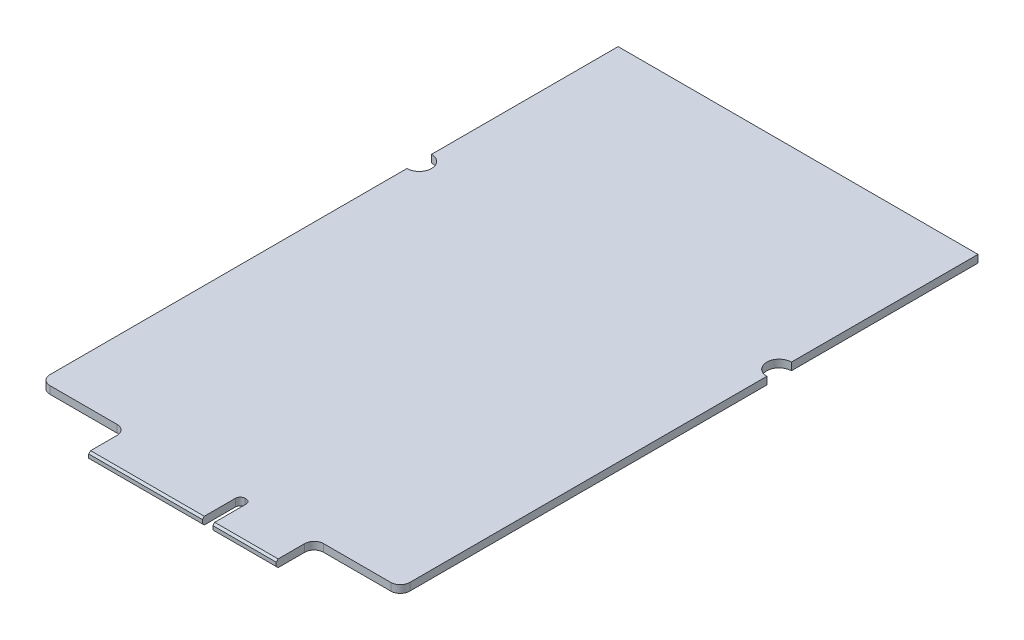
ISO-10303-21;
HEADER;
FILE_DESCRIPTION(('STEP AP214'),'2;1');
FILE_NAME('part.step','',(''),(''),'','','');
FILE_SCHEMA(('AUTOMOTIVE_DESIGN { 1 0 10303 214 1 1 1 1 }'));
ENDSEC;
DATA;
#1=APPLICATION_CONTEXT('core data for automotive mechanical design processes');
#2=APPLICATION_PROTOCOL_DEFINITION('international standard','automotive_design',2000,#1);
#3=PRODUCT_CONTEXT('',#1,'mechanical');
#4=PRODUCT('Part','Part','',(#3));
#5=PRODUCT_RELATED_PRODUCT_CATEGORY('part','',(#4));
#6=PRODUCT_DEFINITION_FORMATION('','',#4);
#7=PRODUCT_DEFINITION_CONTEXT('part definition',#1,'design');
#8=PRODUCT_DEFINITION('design','',#6,#7);
#9=PRODUCT_DEFINITION_SHAPE('','',#8);
#10=(LENGTH_UNIT() NAMED_UNIT(*) SI_UNIT(.MILLI.,.METRE.));
#11=(NAMED_UNIT(*) PLANE_ANGLE_UNIT() SI_UNIT($,.RADIAN.));
#12=(NAMED_UNIT(*) SI_UNIT($,.STERADIAN.) SOLID_ANGLE_UNIT());
#13=UNCERTAINTY_MEASURE_WITH_UNIT(LENGTH_MEASURE(1.E-05),#10,'distance_accuracy_value','');
#14=(GEOMETRIC_REPRESENTATION_CONTEXT(3) GLOBAL_UNCERTAINTY_ASSIGNED_CONTEXT((#13)) GLOBAL_UNIT_ASSIGNED_CONTEXT((#10,
#11,#12)) REPRESENTATION_CONTEXT('',''));
#15=CARTESIAN_POINT('',(0.,0.,0.));
#16=DIRECTION('',(0.,0.,1.));
#17=DIRECTION('',(1.,0.,0.));
#18=AXIS2_PLACEMENT_3D('',#15,#16,#17);
#19=CARTESIAN_POINT('',(38.,0.8,-45.3));
#20=DIRECTION('',(-1.,0.,0.));
#21=DIRECTION('',(0.,0.,1.));
#22=AXIS2_PLACEMENT_3D('',#19,#20,#21);
#23=PLANE('',#22);
#24=DIRECTION('',(0.,0.,-1.));
#25=VECTOR('',#24,1.);
#26=CARTESIAN_POINT('',(38.,0.,-45.3));
#27=LINE('',#26,#25);
#28=CARTESIAN_POINT('',(38.,0.,-45.3));
#29=VERTEX_POINT('',#28);
#30=CARTESIAN_POINT('',(38.,0.,-65.));
#31=VERTEX_POINT('',#30);
#32=EDGE_CURVE('E230',#29,#31,#27,.T.);
#33=ORIENTED_EDGE('',*,*,#32,.T.);
#34=DIRECTION('',(0.,-1.,0.));
#35=VECTOR('',#34,1.);
#36=CARTESIAN_POINT('',(38.,0.8,-65.));
#37=LINE('',#36,#35);
#38=CARTESIAN_POINT('',(38.,0.8,-65.));
#39=VERTEX_POINT('',#38);
#40=EDGE_CURVE('E210',#39,#31,#37,.T.);
#41=ORIENTED_EDGE('',*,*,#40,.F.);
#42=DIRECTION('',(0.,0.,-1.));
#43=VECTOR('',#42,1.);
#44=CARTESIAN_POINT('',(38.,0.8,-45.3));
#45=LINE('',#44,#43);
#46=CARTESIAN_POINT('',(38.,0.8,-45.3));
#47=VERTEX_POINT('',#46);
#48=EDGE_CURVE('E217',#47,#39,#45,.T.);
#49=ORIENTED_EDGE('',*,*,#48,.F.);
#50=DIRECTION('',(0.,-1.,0.));
#51=VECTOR('',#50,1.);
#52=CARTESIAN_POINT('',(38.,0.8,-45.3));
#53=LINE('',#52,#51);
#54=EDGE_CURVE('E366',#47,#29,#53,.T.);
#55=ORIENTED_EDGE('',*,*,#54,.T.);
#56=EDGE_LOOP('',(#33,#41,#49,#55));
#57=FACE_BOUND('',#56,.T.);
#58=ADVANCED_FACE('F33',(#57),#23,.F.);
#59=CARTESIAN_POINT('',(0.,0.8,-65.));
#60=DIRECTION('',(0.,0.,1.));
#61=DIRECTION('',(1.,0.,0.));
#62=AXIS2_PLACEMENT_3D('',#59,#60,#61);
#63=PLANE('',#62);
#64=DIRECTION('',(-1.,0.,0.));
#65=VECTOR('',#64,1.);
#66=CARTESIAN_POINT('',(0.,0.,-65.));
#67=LINE('',#66,#65);
#68=CARTESIAN_POINT('',(0.,0.,-65.));
#69=VERTEX_POINT('',#68);
#70=EDGE_CURVE('E403',#31,#69,#67,.T.);
#71=ORIENTED_EDGE('',*,*,#70,.T.);
#72=DIRECTION('',(0.,-1.,0.));
#73=VECTOR('',#72,1.);
#74=CARTESIAN_POINT('',(0.,0.8,-65.));
#75=LINE('',#74,#73);
#76=CARTESIAN_POINT('',(0.,0.8,-65.));
#77=VERTEX_POINT('',#76);
#78=EDGE_CURVE('E213',#77,#69,#75,.T.);
#79=ORIENTED_EDGE('',*,*,#78,.F.);
#80=DIRECTION('',(-1.,0.,0.));
#81=VECTOR('',#80,1.);
#82=CARTESIAN_POINT('',(0.,0.8,-65.));
#83=LINE('',#82,#81);
#84=EDGE_CURVE('E206',#39,#77,#83,.T.);
#85=ORIENTED_EDGE('',*,*,#84,.F.);
#86=ORIENTED_EDGE('',*,*,#40,.T.);
#87=EDGE_LOOP('',(#71,#79,#85,#86));
#88=FACE_BOUND('',#87,.T.);
#89=ADVANCED_FACE('F208',(#88),#63,.F.);
#90=CARTESIAN_POINT('',(0.,0.8,-45.3));
#91=DIRECTION('',(1.,0.,0.));
#92=DIRECTION('',(0.,0.,-1.));
#93=AXIS2_PLACEMENT_3D('',#90,#91,#92);
#94=PLANE('',#93);
#95=DIRECTION('',(0.,0.,1.));
#96=VECTOR('',#95,1.);
#97=CARTESIAN_POINT('',(0.,0.,-45.3));
#98=LINE('',#97,#96);
#99=CARTESIAN_POINT('',(0.,0.,-45.3));
#100=VERTEX_POINT('',#99);
#101=EDGE_CURVE('E397',#69,#100,#98,.T.);
#102=ORIENTED_EDGE('',*,*,#101,.T.);
#103=DIRECTION('',(0.,-1.,0.));
#104=VECTOR('',#103,1.);
#105=CARTESIAN_POINT('',(0.,0.8,-45.3));
#106=LINE('',#105,#104);
#107=CARTESIAN_POINT('',(0.,0.8,-45.3));
#108=VERTEX_POINT('',#107);
#109=EDGE_CURVE('E235',#108,#100,#106,.T.);
#110=ORIENTED_EDGE('',*,*,#109,.F.);
#111=DIRECTION('',(0.,0.,1.));
#112=VECTOR('',#111,1.);
#113=CARTESIAN_POINT('',(0.,0.8,-45.3));
#114=LINE('',#113,#112);
#115=EDGE_CURVE('E216',#77,#108,#114,.T.);
#116=ORIENTED_EDGE('',*,*,#115,.F.);
#117=ORIENTED_EDGE('',*,*,#78,.T.);
#118=EDGE_LOOP('',(#102,#110,#116,#117));
#119=FACE_BOUND('',#118,.T.);
#120=ADVANCED_FACE('F449',(#119),#94,.F.);
#121=CARTESIAN_POINT('',(0.,0.8,-44.));
#122=DIRECTION('',(0.,-1.,0.));
#123=DIRECTION('',(0.,0.,-1.));
#124=AXIS2_PLACEMENT_3D('',#121,#122,#123);
#125=CYLINDRICAL_SURFACE('',#124,1.3);
#126=CARTESIAN_POINT('',(0.,0.,-44.));
#127=DIRECTION('',(0.,-1.,0.));
#128=DIRECTION('',(0.,0.,1.));
#129=AXIS2_PLACEMENT_3D('',#126,#127,#128);
#130=CIRCLE('',#129,1.3);
#131=CARTESIAN_POINT('',(0.,0.,-42.7));
#132=VERTEX_POINT('',#131);
#133=EDGE_CURVE('E392',#100,#132,#130,.T.);
#134=ORIENTED_EDGE('',*,*,#133,.T.);
#135=DIRECTION('',(0.,-1.,0.));
#136=VECTOR('',#135,1.);
#137=CARTESIAN_POINT('',(0.,0.8,-42.7));
#138=LINE('',#137,#136);
#139=CARTESIAN_POINT('',(0.,0.8,-42.7));
#140=VERTEX_POINT('',#139);
#141=EDGE_CURVE('E383',#140,#132,#138,.T.);
#142=ORIENTED_EDGE('',*,*,#141,.F.);
#143=CARTESIAN_POINT('',(0.,0.8,-44.));
#144=DIRECTION('',(0.,-1.,0.));
#145=DIRECTION('',(0.,0.,1.));
#146=AXIS2_PLACEMENT_3D('',#143,#144,#145);
#147=CIRCLE('',#146,1.3);
#148=EDGE_CURVE('E393',#108,#140,#147,.T.);
#149=ORIENTED_EDGE('',*,*,#148,.F.);
#150=ORIENTED_EDGE('',*,*,#109,.T.);
#151=EDGE_LOOP('',(#134,#142,#149,#150));
#152=FACE_BOUND('',#151,.T.);
#153=ADVANCED_FACE('F390',(#152),#125,.F.);
#154=CARTESIAN_POINT('',(0.,0.8,-4.));
#155=DIRECTION('',(1.,0.,0.));
#156=DIRECTION('',(0.,0.,-1.));
#157=AXIS2_PLACEMENT_3D('',#154,#155,#156);
#158=PLANE('',#157);
#159=DIRECTION('',(0.,0.,1.));
#160=VECTOR('',#159,1.);
#161=CARTESIAN_POINT('',(0.,0.,-4.));
#162=LINE('',#161,#160);
#163=CARTESIAN_POINT('',(0.,0.,-5.));
#164=VERTEX_POINT('',#163);
#165=EDGE_CURVE('E399',#132,#164,#162,.T.);
#166=ORIENTED_EDGE('',*,*,#165,.T.);
#167=DIRECTION('',(0.,-1.,0.));
#168=VECTOR('',#167,1.);
#169=CARTESIAN_POINT('',(0.,0.8,-5.));
#170=LINE('',#169,#168);
#171=CARTESIAN_POINT('',(0.,0.8,-5.));
#172=VERTEX_POINT('',#171);
#173=EDGE_CURVE('E285',#164,#172,#170,.F.);
#174=ORIENTED_EDGE('',*,*,#173,.T.);
#175=DIRECTION('',(0.,0.,1.));
#176=VECTOR('',#175,1.);
#177=CARTESIAN_POINT('',(0.,0.8,-4.));
#178=LINE('',#177,#176);
#179=EDGE_CURVE('E436',#140,#172,#178,.T.);
#180=ORIENTED_EDGE('',*,*,#179,.F.);
#181=ORIENTED_EDGE('',*,*,#141,.T.);
#182=EDGE_LOOP('',(#166,#174,#180,#181));
#183=FACE_BOUND('',#182,.T.);
#184=ADVANCED_FACE('F604',(#183),#158,.F.);
#185=CARTESIAN_POINT('',(0.,0.8,-4.));
#186=DIRECTION('',(0.,0.,-1.));
#187=DIRECTION('',(-1.,0.,0.));
#188=AXIS2_PLACEMENT_3D('',#185,#186,#187);
#189=PLANE('',#188);
#190=DIRECTION('',(1.,0.,0.));
#191=VECTOR('',#190,1.);
#192=CARTESIAN_POINT('',(0.,0.8,-4.));
#193=LINE('',#192,#191);
#194=CARTESIAN_POINT('',(1.,0.8,-4.));
#195=VERTEX_POINT('',#194);
#196=CARTESIAN_POINT('',(8.10000000000001,0.8,-4.));
#197=VERTEX_POINT('',#196);
#198=EDGE_CURVE('E433',#195,#197,#193,.T.);
#199=ORIENTED_EDGE('',*,*,#198,.F.);
#200=DIRECTION('',(0.,-1.,0.));
#201=VECTOR('',#200,1.);
#202=CARTESIAN_POINT('',(1.,0.8,-4.));
#203=LINE('',#202,#201);
#204=CARTESIAN_POINT('',(1.,0.,-4.));
#205=VERTEX_POINT('',#204);
#206=EDGE_CURVE('E278',#195,#205,#203,.T.);
#207=ORIENTED_EDGE('',*,*,#206,.T.);
#208=DIRECTION('',(1.,0.,0.));
#209=VECTOR('',#208,1.);
#210=CARTESIAN_POINT('',(0.,0.,-4.));
#211=LINE('',#210,#209);
#212=CARTESIAN_POINT('',(8.10000000000001,0.,-4.));
#213=VERTEX_POINT('',#212);
#214=EDGE_CURVE('E401',#205,#213,#211,.T.);
#215=ORIENTED_EDGE('',*,*,#214,.T.);
#216=DIRECTION('',(0.,-1.,0.));
#217=VECTOR('',#216,1.);
#218=CARTESIAN_POINT('',(8.10000000000001,0.8,-4.));
#219=LINE('',#218,#217);
#220=EDGE_CURVE('E276',#213,#197,#219,.F.);
#221=ORIENTED_EDGE('',*,*,#220,.T.);
#222=EDGE_LOOP('',(#199,#207,#215,#221));
#223=FACE_BOUND('',#222,.T.);
#224=ADVANCED_FACE('F461',(#223),#189,.F.);
#225=CARTESIAN_POINT('',(9.10000000000001,0.8,0.));
#226=DIRECTION('',(1.,0.,0.));
#227=DIRECTION('',(0.,0.,-1.));
#228=AXIS2_PLACEMENT_3D('',#225,#226,#227);
#229=PLANE('',#228);
#230=DIRECTION('',(0.,0.,1.));
#231=VECTOR('',#230,1.);
#232=CARTESIAN_POINT('',(9.10000000000001,0.8,0.));
#233=LINE('',#232,#231);
#234=CARTESIAN_POINT('',(9.10000000000001,0.8,-3.));
#235=VERTEX_POINT('',#234);
#236=CARTESIAN_POINT('',(9.10000000000001,0.8,-0.19999999999999));
#237=VERTEX_POINT('',#236);
#238=EDGE_CURVE('E430',#235,#237,#233,.T.);
#239=ORIENTED_EDGE('',*,*,#238,.F.);
#240=DIRECTION('',(0.,-1.,0.));
#241=VECTOR('',#240,1.);
#242=CARTESIAN_POINT('',(9.10000000000001,0.,-3.));
#243=LINE('',#242,#241);
#244=CARTESIAN_POINT('',(9.10000000000001,0.,-3.));
#245=VERTEX_POINT('',#244);
#246=EDGE_CURVE('E299',#235,#245,#243,.T.);
#247=ORIENTED_EDGE('',*,*,#246,.T.);
#248=DIRECTION('',(0.,0.,1.));
#249=VECTOR('',#248,1.);
#250=CARTESIAN_POINT('',(9.10000000000001,0.,0.));
#251=LINE('',#250,#249);
#252=CARTESIAN_POINT('',(9.10000000000001,0.,-0.199999999999997));
#253=VERTEX_POINT('',#252);
#254=EDGE_CURVE('E354',#245,#253,#251,.T.);
#255=ORIENTED_EDGE('',*,*,#254,.T.);
#256=DIRECTION('',(0.,-0.70710678118654,-0.707106781186555));
#257=VECTOR('',#256,1.);
#258=CARTESIAN_POINT('',(9.10000000000001,0.199999999999992,0.));
#259=LINE('',#258,#257);
#260=CARTESIAN_POINT('',(9.10000000000001,0.199999999999992,0.));
#261=VERTEX_POINT('',#260);
#262=EDGE_CURVE('E254',#253,#261,#259,.F.);
#263=ORIENTED_EDGE('',*,*,#262,.T.);
#264=DIRECTION('',(0.,-1.,0.));
#265=VECTOR('',#264,1.);
#266=CARTESIAN_POINT('',(9.10000000000001,0.8,0.));
#267=LINE('',#266,#265);
#268=CARTESIAN_POINT('',(9.10000000000001,0.600000000000001,0.));
#269=VERTEX_POINT('',#268);
#270=EDGE_CURVE('E380',#269,#261,#267,.T.);
#271=ORIENTED_EDGE('',*,*,#270,.F.);
#272=DIRECTION('',(0.,0.707106781186564,-0.707106781186531));
#273=VECTOR('',#272,1.);
#274=CARTESIAN_POINT('',(9.10000000000001,0.800000000000011,-0.200000000000001));
#275=LINE('',#274,#273);
#276=EDGE_CURVE('E251',#269,#237,#275,.T.);
#277=ORIENTED_EDGE('',*,*,#276,.T.);
#278=EDGE_LOOP('',(#239,#247,#255,#263,#271,#277));
#279=FACE_BOUND('',#278,.T.);
#280=ADVANCED_FACE('F411',(#279),#229,.F.);
#281=CARTESIAN_POINT('',(9.10000000000001,0.8,0.));
#282=DIRECTION('',(0.,0.,-1.));
#283=DIRECTION('',(-1.,0.,0.));
#284=AXIS2_PLACEMENT_3D('',#281,#282,#283);
#285=PLANE('',#284);
#286=ORIENTED_EDGE('',*,*,#270,.T.);
#287=DIRECTION('',(1.,0.,0.));
#288=VECTOR('',#287,1.);
#289=CARTESIAN_POINT('',(9.10000000000001,0.199999999999992,0.));
#290=LINE('',#289,#288);
#291=CARTESIAN_POINT('',(21.1,0.199999999999992,0.));
#292=VERTEX_POINT('',#291);
#293=EDGE_CURVE('E233',#261,#292,#290,.T.);
#294=ORIENTED_EDGE('',*,*,#293,.T.);
#295=DIRECTION('',(0.,-1.,0.));
#296=VECTOR('',#295,1.);
#297=CARTESIAN_POINT('',(21.1,0.8,0.));
#298=LINE('',#297,#296);
#299=CARTESIAN_POINT('',(21.1,0.600000000000001,0.));
#300=VERTEX_POINT('',#299);
#301=EDGE_CURVE('E377',#300,#292,#298,.T.);
#302=ORIENTED_EDGE('',*,*,#301,.F.);
#303=DIRECTION('',(-1.,0.,0.));
#304=VECTOR('',#303,1.);
#305=CARTESIAN_POINT('',(9.10000000000001,0.600000000000001,0.));
#306=LINE('',#305,#304);
#307=EDGE_CURVE('E231',#300,#269,#306,.T.);
#308=ORIENTED_EDGE('',*,*,#307,.T.);
#309=EDGE_LOOP('',(#286,#294,#302,#308));
#310=FACE_BOUND('',#309,.T.);
#311=ADVANCED_FACE('F421',(#310),#285,.F.);
#312=CARTESIAN_POINT('',(21.1,0.8,0.));
#313=DIRECTION('',(-1.,0.,0.));
#314=DIRECTION('',(0.,0.,1.));
#315=AXIS2_PLACEMENT_3D('',#312,#313,#314);
#316=PLANE('',#315);
#317=DIRECTION('',(0.,0.,-1.));
#318=VECTOR('',#317,1.);
#319=CARTESIAN_POINT('',(21.1,0.,0.));
#320=LINE('',#319,#318);
#321=CARTESIAN_POINT('',(21.1,0.,-0.199999999999995));
#322=VERTEX_POINT('',#321);
#323=CARTESIAN_POINT('',(21.1,0.,-3.5));
#324=VERTEX_POINT('',#323);
#325=EDGE_CURVE('E350',#322,#324,#320,.T.);
#326=ORIENTED_EDGE('',*,*,#325,.T.);
#327=DIRECTION('',(0.,-1.,0.));
#328=VECTOR('',#327,1.);
#329=CARTESIAN_POINT('',(21.1,0.8,-3.5));
#330=LINE('',#329,#328);
#331=CARTESIAN_POINT('',(21.1,0.8,-3.5));
#332=VERTEX_POINT('',#331);
#333=EDGE_CURVE('E48',#324,#332,#330,.F.);
#334=ORIENTED_EDGE('',*,*,#333,.T.);
#335=DIRECTION('',(0.,0.,-1.));
#336=VECTOR('',#335,1.);
#337=CARTESIAN_POINT('',(21.1,0.8,0.));
#338=LINE('',#337,#336);
#339=CARTESIAN_POINT('',(21.1,0.8,-0.199999999999988));
#340=VERTEX_POINT('',#339);
#341=EDGE_CURVE('E424',#340,#332,#338,.T.);
#342=ORIENTED_EDGE('',*,*,#341,.F.);
#343=DIRECTION('',(0.,-0.707106781186564,0.707106781186531));
#344=VECTOR('',#343,1.);
#345=CARTESIAN_POINT('',(21.1,0.800000000000048,-0.200000000000036));
#346=LINE('',#345,#344);
#347=EDGE_CURVE('E241',#340,#300,#346,.T.);
#348=ORIENTED_EDGE('',*,*,#347,.T.);
#349=ORIENTED_EDGE('',*,*,#301,.T.);
#350=DIRECTION('',(0.,0.70710678118654,0.707106781186555));
#351=VECTOR('',#350,1.);
#352=CARTESIAN_POINT('',(21.1,0.199999999999965,0.));
#353=LINE('',#352,#351);
#354=EDGE_CURVE('E243',#292,#322,#353,.F.);
#355=ORIENTED_EDGE('',*,*,#354,.T.);
#356=EDGE_LOOP('',(#326,#334,#342,#348,#349,#355));
#357=FACE_BOUND('',#356,.T.);
#358=ADVANCED_FACE('F423',(#357),#316,.F.);
#359=CARTESIAN_POINT('',(21.1,0.8,-4.00000000000001));
#360=DIRECTION('',(0.,0.,-1.));
#361=DIRECTION('',(-1.,0.,0.));
#362=AXIS2_PLACEMENT_3D('',#359,#360,#361);
#363=PLANE('',#362);
#364=DIRECTION('',(1.,0.,0.));
#365=VECTOR('',#364,1.);
#366=CARTESIAN_POINT('',(21.1,0.,-4.00000000000001));
#367=LINE('',#366,#365);
#368=CARTESIAN_POINT('',(21.6,0.,-4.00000000000001));
#369=VERTEX_POINT('',#368);
#370=CARTESIAN_POINT('',(21.7,0.,-4.00000000000001));
#371=VERTEX_POINT('',#370);
#372=EDGE_CURVE('E345',#369,#371,#367,.T.);
#373=ORIENTED_EDGE('',*,*,#372,.T.);
#374=DIRECTION('',(0.,-1.,0.));
#375=VECTOR('',#374,1.);
#376=CARTESIAN_POINT('',(21.7,0.8,-4.00000000000001));
#377=LINE('',#376,#375);
#378=CARTESIAN_POINT('',(21.7,0.8,-4.00000000000001));
#379=VERTEX_POINT('',#378);
#380=EDGE_CURVE('E318',#371,#379,#377,.F.);
#381=ORIENTED_EDGE('',*,*,#380,.T.);
#382=DIRECTION('',(1.,0.,0.));
#383=VECTOR('',#382,1.);
#384=CARTESIAN_POINT('',(21.1,0.8,-4.00000000000001));
#385=LINE('',#384,#383);
#386=CARTESIAN_POINT('',(21.6,0.8,-4.00000000000001));
#387=VERTEX_POINT('',#386);
#388=EDGE_CURVE('E329',#387,#379,#385,.T.);
#389=ORIENTED_EDGE('',*,*,#388,.F.);
#390=DIRECTION('',(0.,-1.,0.));
#391=VECTOR('',#390,1.);
#392=CARTESIAN_POINT('',(21.6,0.,-4.00000000000001));
#393=LINE('',#392,#391);
#394=EDGE_CURVE('E315',#387,#369,#393,.T.);
#395=ORIENTED_EDGE('',*,*,#394,.T.);
#396=EDGE_LOOP('',(#373,#381,#389,#395));
#397=FACE_BOUND('',#396,.T.);
#398=ADVANCED_FACE('F348',(#397),#363,.F.);
#399=CARTESIAN_POINT('',(22.2,0.8,0.));
#400=DIRECTION('',(1.,0.,0.));
#401=DIRECTION('',(0.,0.,-1.));
#402=AXIS2_PLACEMENT_3D('',#399,#400,#401);
#403=PLANE('',#402);
#404=DIRECTION('',(0.,0.,1.));
#405=VECTOR('',#404,1.);
#406=CARTESIAN_POINT('',(22.2,0.8,0.));
#407=LINE('',#406,#405);
#408=CARTESIAN_POINT('',(22.2,0.8,-3.50000000000001));
#409=VERTEX_POINT('',#408);
#410=CARTESIAN_POINT('',(22.2,0.8,-0.19999999999999));
#411=VERTEX_POINT('',#410);
#412=EDGE_CURVE('E327',#409,#411,#407,.T.);
#413=ORIENTED_EDGE('',*,*,#412,.F.);
#414=DIRECTION('',(0.,-1.,0.));
#415=VECTOR('',#414,1.);
#416=CARTESIAN_POINT('',(22.2,0.,-3.50000000000001));
#417=LINE('',#416,#415);
#418=CARTESIAN_POINT('',(22.2,0.,-3.50000000000001));
#419=VERTEX_POINT('',#418);
#420=EDGE_CURVE('E312',#409,#419,#417,.T.);
#421=ORIENTED_EDGE('',*,*,#420,.T.);
#422=DIRECTION('',(0.,0.,1.));
#423=VECTOR('',#422,1.);
#424=CARTESIAN_POINT('',(22.2,0.,0.));
#425=LINE('',#424,#423);
#426=CARTESIAN_POINT('',(22.2,0.,-0.199999999999997));
#427=VERTEX_POINT('',#426);
#428=EDGE_CURVE('E346',#419,#427,#425,.T.);
#429=ORIENTED_EDGE('',*,*,#428,.T.);
#430=DIRECTION('',(0.,-0.707106781186538,-0.707106781186557));
#431=VECTOR('',#430,1.);
#432=CARTESIAN_POINT('',(22.2,0.199999999999992,0.));
#433=LINE('',#432,#431);
#434=CARTESIAN_POINT('',(22.2,0.199999999999992,0.));
#435=VERTEX_POINT('',#434);
#436=EDGE_CURVE('E268',#427,#435,#433,.F.);
#437=ORIENTED_EDGE('',*,*,#436,.T.);
#438=DIRECTION('',(0.,-1.,0.));
#439=VECTOR('',#438,1.);
#440=CARTESIAN_POINT('',(22.2,0.8,0.));
#441=LINE('',#440,#439);
#442=CARTESIAN_POINT('',(22.2,0.600000000000001,0.));
#443=VERTEX_POINT('',#442);
#444=EDGE_CURVE('E374',#443,#435,#441,.T.);
#445=ORIENTED_EDGE('',*,*,#444,.F.);
#446=DIRECTION('',(0.,0.707106781186563,-0.707106781186532));
#447=VECTOR('',#446,1.);
#448=CARTESIAN_POINT('',(22.2,0.800000000000078,-0.200000000000068));
#449=LINE('',#448,#447);
#450=EDGE_CURVE('E265',#443,#411,#449,.T.);
#451=ORIENTED_EDGE('',*,*,#450,.T.);
#452=EDGE_LOOP('',(#413,#421,#429,#437,#445,#451));
#453=FACE_BOUND('',#452,.T.);
#454=ADVANCED_FACE('F334',(#453),#403,.F.);
#455=CARTESIAN_POINT('',(22.2,0.8,0.));
#456=DIRECTION('',(0.,0.,-1.));
#457=DIRECTION('',(-1.,0.,0.));
#458=AXIS2_PLACEMENT_3D('',#455,#456,#457);
#459=PLANE('',#458);
#460=ORIENTED_EDGE('',*,*,#444,.T.);
#461=DIRECTION('',(1.,0.,0.));
#462=VECTOR('',#461,1.);
#463=CARTESIAN_POINT('',(22.2,0.199999999999992,0.));
#464=LINE('',#463,#462);
#465=CARTESIAN_POINT('',(28.9,0.199999999999992,0.));
#466=VERTEX_POINT('',#465);
#467=EDGE_CURVE('E258',#435,#466,#464,.T.);
#468=ORIENTED_EDGE('',*,*,#467,.T.);
#469=DIRECTION('',(0.,-1.,0.));
#470=VECTOR('',#469,1.);
#471=CARTESIAN_POINT('',(28.9,0.8,0.));
#472=LINE('',#471,#470);
#473=CARTESIAN_POINT('',(28.9,0.600000000000001,0.));
#474=VERTEX_POINT('',#473);
#475=EDGE_CURVE('E371',#474,#466,#472,.T.);
#476=ORIENTED_EDGE('',*,*,#475,.F.);
#477=DIRECTION('',(-1.,0.,0.));
#478=VECTOR('',#477,1.);
#479=CARTESIAN_POINT('',(22.2,0.600000000000001,0.));
#480=LINE('',#479,#478);
#481=EDGE_CURVE('E256',#474,#443,#480,.T.);
#482=ORIENTED_EDGE('',*,*,#481,.T.);
#483=EDGE_LOOP('',(#460,#468,#476,#482));
#484=FACE_BOUND('',#483,.T.);
#485=ADVANCED_FACE('F546',(#484),#459,.F.);
#486=CARTESIAN_POINT('',(28.9,0.8,0.));
#487=DIRECTION('',(-1.,0.,0.));
#488=DIRECTION('',(0.,0.,1.));
#489=AXIS2_PLACEMENT_3D('',#486,#487,#488);
#490=PLANE('',#489);
#491=DIRECTION('',(0.,0.,-1.));
#492=VECTOR('',#491,1.);
#493=CARTESIAN_POINT('',(28.9,0.,0.));
#494=LINE('',#493,#492);
#495=CARTESIAN_POINT('',(28.9,0.,-0.199999999999997));
#496=VERTEX_POINT('',#495);
#497=CARTESIAN_POINT('',(28.9,0.,-3.00000000000001));
#498=VERTEX_POINT('',#497);
#499=EDGE_CURVE('E352',#496,#498,#494,.T.);
#500=ORIENTED_EDGE('',*,*,#499,.T.);
#501=DIRECTION('',(0.,-1.,0.));
#502=VECTOR('',#501,1.);
#503=CARTESIAN_POINT('',(28.9,0.8,-3.00000000000001));
#504=LINE('',#503,#502);
#505=CARTESIAN_POINT('',(28.9,0.8,-3.00000000000001));
#506=VERTEX_POINT('',#505);
#507=EDGE_CURVE('E302',#498,#506,#504,.F.);
#508=ORIENTED_EDGE('',*,*,#507,.T.);
#509=DIRECTION('',(0.,0.,-1.));
#510=VECTOR('',#509,1.);
#511=CARTESIAN_POINT('',(28.9,0.8,0.));
#512=LINE('',#511,#510);
#513=CARTESIAN_POINT('',(28.9,0.8,-0.19999999999999));
#514=VERTEX_POINT('',#513);
#515=EDGE_CURVE('E339',#514,#506,#512,.T.);
#516=ORIENTED_EDGE('',*,*,#515,.F.);
#517=DIRECTION('',(0.,-0.707106781186563,0.707106781186532));
#518=VECTOR('',#517,1.);
#519=CARTESIAN_POINT('',(28.9,0.800000000000026,-0.200000000000016));
#520=LINE('',#519,#518);
#521=EDGE_CURVE('E261',#514,#474,#520,.T.);
#522=ORIENTED_EDGE('',*,*,#521,.T.);
#523=ORIENTED_EDGE('',*,*,#475,.T.);
#524=DIRECTION('',(0.,0.707106781186538,0.707106781186557));
#525=VECTOR('',#524,1.);
#526=CARTESIAN_POINT('',(28.9,0.199999999999986,0.));
#527=LINE('',#526,#525);
#528=EDGE_CURVE('E263',#466,#496,#527,.F.);
#529=ORIENTED_EDGE('',*,*,#528,.T.);
#530=EDGE_LOOP('',(#500,#508,#516,#522,#523,#529));
#531=FACE_BOUND('',#530,.T.);
#532=ADVANCED_FACE('F631',(#531),#490,.F.);
#533=CARTESIAN_POINT('',(38.,0.8,-4.00000000000001));
#534=DIRECTION('',(0.,0.,-1.));
#535=DIRECTION('',(-1.,0.,0.));
#536=AXIS2_PLACEMENT_3D('',#533,#534,#535);
#537=PLANE('',#536);
#538=DIRECTION('',(1.,0.,0.));
#539=VECTOR('',#538,1.);
#540=CARTESIAN_POINT('',(38.,0.,-4.00000000000001));
#541=LINE('',#540,#539);
#542=CARTESIAN_POINT('',(29.9,0.,-4.00000000000001));
#543=VERTEX_POINT('',#542);
#544=CARTESIAN_POINT('',(37.,0.,-4.00000000000001));
#545=VERTEX_POINT('',#544);
#546=EDGE_CURVE('E360',#543,#545,#541,.T.);
#547=ORIENTED_EDGE('',*,*,#546,.T.);
#548=DIRECTION('',(0.,-1.,0.));
#549=VECTOR('',#548,1.);
#550=CARTESIAN_POINT('',(37.,0.8,-4.00000000000001));
#551=LINE('',#550,#549);
#552=CARTESIAN_POINT('',(37.,0.8,-4.00000000000001));
#553=VERTEX_POINT('',#552);
#554=EDGE_CURVE('E297',#545,#553,#551,.F.);
#555=ORIENTED_EDGE('',*,*,#554,.T.);
#556=DIRECTION('',(1.,0.,0.));
#557=VECTOR('',#556,1.);
#558=CARTESIAN_POINT('',(38.,0.8,-4.00000000000001));
#559=LINE('',#558,#557);
#560=CARTESIAN_POINT('',(29.9,0.8,-4.00000000000001));
#561=VERTEX_POINT('',#560);
#562=EDGE_CURVE('E443',#561,#553,#559,.T.);
#563=ORIENTED_EDGE('',*,*,#562,.F.);
#564=DIRECTION('',(0.,-1.,0.));
#565=VECTOR('',#564,1.);
#566=CARTESIAN_POINT('',(29.9,0.,-4.00000000000001));
#567=LINE('',#566,#565);
#568=EDGE_CURVE('E294',#561,#543,#567,.T.);
#569=ORIENTED_EDGE('',*,*,#568,.T.);
#570=EDGE_LOOP('',(#547,#555,#563,#569));
#571=FACE_BOUND('',#570,.T.);
#572=ADVANCED_FACE('F636',(#571),#537,.F.);
#573=CARTESIAN_POINT('',(38.,0.8,-4.00000000000001));
#574=DIRECTION('',(-1.,0.,0.));
#575=DIRECTION('',(0.,0.,1.));
#576=AXIS2_PLACEMENT_3D('',#573,#574,#575);
#577=PLANE('',#576);
#578=DIRECTION('',(0.,0.,-1.));
#579=VECTOR('',#578,1.);
#580=CARTESIAN_POINT('',(38.,0.8,-4.00000000000001));
#581=LINE('',#580,#579);
#582=CARTESIAN_POINT('',(38.,0.8,-5.00000000000001));
#583=VERTEX_POINT('',#582);
#584=CARTESIAN_POINT('',(38.,0.8,-42.7));
#585=VERTEX_POINT('',#584);
#586=EDGE_CURVE('E446',#583,#585,#581,.T.);
#587=ORIENTED_EDGE('',*,*,#586,.F.);
#588=DIRECTION('',(0.,-1.,0.));
#589=VECTOR('',#588,1.);
#590=CARTESIAN_POINT('',(38.,0.8,-5.00000000000001));
#591=LINE('',#590,#589);
#592=CARTESIAN_POINT('',(38.,0.,-5.00000000000001));
#593=VERTEX_POINT('',#592);
#594=EDGE_CURVE('E291',#583,#593,#591,.T.);
#595=ORIENTED_EDGE('',*,*,#594,.T.);
#596=DIRECTION('',(0.,0.,-1.));
#597=VECTOR('',#596,1.);
#598=CARTESIAN_POINT('',(38.,0.,-4.00000000000001));
#599=LINE('',#598,#597);
#600=CARTESIAN_POINT('',(38.,0.,-42.7));
#601=VERTEX_POINT('',#600);
#602=EDGE_CURVE('E363',#593,#601,#599,.T.);
#603=ORIENTED_EDGE('',*,*,#602,.T.);
#604=DIRECTION('',(0.,-1.,0.));
#605=VECTOR('',#604,1.);
#606=CARTESIAN_POINT('',(38.,0.8,-42.7));
#607=LINE('',#606,#605);
#608=EDGE_CURVE('E368',#585,#601,#607,.T.);
#609=ORIENTED_EDGE('',*,*,#608,.F.);
#610=EDGE_LOOP('',(#587,#595,#603,#609));
#611=FACE_BOUND('',#610,.T.);
#612=ADVANCED_FACE('F645',(#611),#577,.F.);
#613=CARTESIAN_POINT('',(38.,0.8,-44.));
#614=DIRECTION('',(0.,-1.,0.));
#615=DIRECTION('',(0.,0.,-1.));
#616=AXIS2_PLACEMENT_3D('',#613,#614,#615);
#617=CYLINDRICAL_SURFACE('',#616,1.3);
#618=CARTESIAN_POINT('',(38.,0.,-44.));
#619=DIRECTION('',(0.,-1.,0.));
#620=DIRECTION('',(0.,0.,1.));
#621=AXIS2_PLACEMENT_3D('',#618,#619,#620);
#622=CIRCLE('',#621,1.3);
#623=EDGE_CURVE('E227',#601,#29,#622,.T.);
#624=ORIENTED_EDGE('',*,*,#623,.T.);
#625=ORIENTED_EDGE('',*,*,#54,.F.);
#626=CARTESIAN_POINT('',(38.,0.8,-44.));
#627=DIRECTION('',(0.,-1.,0.));
#628=DIRECTION('',(0.,0.,1.));
#629=AXIS2_PLACEMENT_3D('',#626,#627,#628);
#630=CIRCLE('',#629,1.3);
#631=EDGE_CURVE('E223',#585,#47,#630,.T.);
#632=ORIENTED_EDGE('',*,*,#631,.F.);
#633=ORIENTED_EDGE('',*,*,#608,.T.);
#634=EDGE_LOOP('',(#624,#625,#632,#633));
#635=FACE_BOUND('',#634,.T.);
#636=ADVANCED_FACE('F557',(#635),#617,.F.);
#637=CARTESIAN_POINT('',(0.,0.8,-44.));
#638=DIRECTION('',(0.,1.,0.));
#639=DIRECTION('',(0.,0.,1.));
#640=AXIS2_PLACEMENT_3D('',#637,#638,#639);
#641=PLANE('',#640);
#642=ORIENTED_EDGE('',*,*,#179,.T.);
#643=CARTESIAN_POINT('',(1.,0.8,-5.));
#644=DIRECTION('',(0.,1.,0.));
#645=DIRECTION('',(0.,0.,1.));
#646=AXIS2_PLACEMENT_3D('',#643,#644,#645);
#647=CIRCLE('',#646,1.);
#648=EDGE_CURVE('E289',#172,#195,#647,.T.);
#649=ORIENTED_EDGE('',*,*,#648,.T.);
#650=ORIENTED_EDGE('',*,*,#198,.T.);
#651=CARTESIAN_POINT('',(8.10000000000001,0.8,-3.));
#652=DIRECTION('',(0.,1.,0.));
#653=DIRECTION('',(0.,0.,1.));
#654=AXIS2_PLACEMENT_3D('',#651,#652,#653);
#655=CIRCLE('',#654,1.);
#656=EDGE_CURVE('E306',#197,#235,#655,.F.);
#657=ORIENTED_EDGE('',*,*,#656,.T.);
#658=ORIENTED_EDGE('',*,*,#238,.T.);
#659=DIRECTION('',(1.,0.,0.));
#660=VECTOR('',#659,1.);
#661=CARTESIAN_POINT('',(21.1,0.8,-0.199999999999988));
#662=LINE('',#661,#660);
#663=EDGE_CURVE('E270',#237,#340,#662,.T.);
#664=ORIENTED_EDGE('',*,*,#663,.T.);
#665=ORIENTED_EDGE('',*,*,#341,.T.);
#666=CARTESIAN_POINT('',(21.6,0.8,-3.50000000000001));
#667=DIRECTION('',(0.,1.,0.));
#668=DIRECTION('',(0.,0.,1.));
#669=AXIS2_PLACEMENT_3D('',#666,#667,#668);
#670=CIRCLE('',#669,0.5);
#671=EDGE_CURVE('E11',#332,#387,#670,.F.);
#672=ORIENTED_EDGE('',*,*,#671,.T.);
#673=ORIENTED_EDGE('',*,*,#388,.T.);
#674=CARTESIAN_POINT('',(21.7,0.8,-3.50000000000001));
#675=DIRECTION('',(0.,1.,0.));
#676=DIRECTION('',(0.,0.,1.));
#677=AXIS2_PLACEMENT_3D('',#674,#675,#676);
#678=CIRCLE('',#677,0.5);
#679=EDGE_CURVE('E323',#379,#409,#678,.F.);
#680=ORIENTED_EDGE('',*,*,#679,.T.);
#681=ORIENTED_EDGE('',*,*,#412,.T.);
#682=DIRECTION('',(1.,0.,0.));
#683=VECTOR('',#682,1.);
#684=CARTESIAN_POINT('',(28.9,0.8,-0.19999999999999));
#685=LINE('',#684,#683);
#686=EDGE_CURVE('E273',#411,#514,#685,.T.);
#687=ORIENTED_EDGE('',*,*,#686,.T.);
#688=ORIENTED_EDGE('',*,*,#515,.T.);
#689=CARTESIAN_POINT('',(29.9,0.8,-3.00000000000001));
#690=DIRECTION('',(0.,1.,0.));
#691=DIRECTION('',(0.,0.,1.));
#692=AXIS2_PLACEMENT_3D('',#689,#690,#691);
#693=CIRCLE('',#692,1.);
#694=EDGE_CURVE('E310',#506,#561,#693,.F.);
#695=ORIENTED_EDGE('',*,*,#694,.T.);
#696=ORIENTED_EDGE('',*,*,#562,.T.);
#697=CARTESIAN_POINT('',(37.,0.8,-5.00000000000001));
#698=DIRECTION('',(0.,1.,0.));
#699=DIRECTION('',(0.,0.,1.));
#700=AXIS2_PLACEMENT_3D('',#697,#698,#699);
#701=CIRCLE('',#700,1.);
#702=EDGE_CURVE('E287',#553,#583,#701,.T.);
#703=ORIENTED_EDGE('',*,*,#702,.T.);
#704=ORIENTED_EDGE('',*,*,#586,.T.);
#705=ORIENTED_EDGE('',*,*,#631,.T.);
#706=ORIENTED_EDGE('',*,*,#48,.T.);
#707=ORIENTED_EDGE('',*,*,#84,.T.);
#708=ORIENTED_EDGE('',*,*,#115,.T.);
#709=ORIENTED_EDGE('',*,*,#148,.T.);
#710=EDGE_LOOP('',(#642,#649,#650,#657,#658,#664,#665,#672,#673,#680,#681,#687,#688,#695,#696,
#703,#704,#705,#706,#707,#708,#709));
#711=FACE_BOUND('',#710,.T.);
#712=ADVANCED_FACE('F221',(#711),#641,.T.);
#713=CARTESIAN_POINT('',(0.,0.,-44.));
#714=DIRECTION('',(0.,1.,0.));
#715=DIRECTION('',(0.,0.,1.));
#716=AXIS2_PLACEMENT_3D('',#713,#714,#715);
#717=PLANE('',#716);
#718=ORIENTED_EDGE('',*,*,#214,.F.);
#719=CARTESIAN_POINT('',(1.,0.,-5.));
#720=DIRECTION('',(0.,1.,0.));
#721=DIRECTION('',(0.,0.,1.));
#722=AXIS2_PLACEMENT_3D('',#719,#720,#721);
#723=CIRCLE('',#722,1.);
#724=EDGE_CURVE('E283',#205,#164,#723,.F.);
#725=ORIENTED_EDGE('',*,*,#724,.T.);
#726=ORIENTED_EDGE('',*,*,#165,.F.);
#727=ORIENTED_EDGE('',*,*,#133,.F.);
#728=ORIENTED_EDGE('',*,*,#101,.F.);
#729=ORIENTED_EDGE('',*,*,#70,.F.);
#730=ORIENTED_EDGE('',*,*,#32,.F.);
#731=ORIENTED_EDGE('',*,*,#623,.F.);
#732=ORIENTED_EDGE('',*,*,#602,.F.);
#733=CARTESIAN_POINT('',(37.,0.,-5.00000000000001));
#734=DIRECTION('',(0.,1.,0.));
#735=DIRECTION('',(0.,0.,1.));
#736=AXIS2_PLACEMENT_3D('',#733,#734,#735);
#737=CIRCLE('',#736,1.);
#738=EDGE_CURVE('E281',#593,#545,#737,.F.);
#739=ORIENTED_EDGE('',*,*,#738,.T.);
#740=ORIENTED_EDGE('',*,*,#546,.F.);
#741=CARTESIAN_POINT('',(29.9,0.,-3.00000000000001));
#742=DIRECTION('',(0.,1.,0.));
#743=DIRECTION('',(0.,0.,1.));
#744=AXIS2_PLACEMENT_3D('',#741,#742,#743);
#745=CIRCLE('',#744,1.);
#746=EDGE_CURVE('E308',#543,#498,#745,.T.);
#747=ORIENTED_EDGE('',*,*,#746,.T.);
#748=ORIENTED_EDGE('',*,*,#499,.F.);
#749=DIRECTION('',(-1.,0.,0.));
#750=VECTOR('',#749,1.);
#751=CARTESIAN_POINT('',(0.,0.,-0.199999999999999));
#752=LINE('',#751,#750);
#753=EDGE_CURVE('E245',#496,#427,#752,.T.);
#754=ORIENTED_EDGE('',*,*,#753,.T.);
#755=ORIENTED_EDGE('',*,*,#428,.F.);
#756=CARTESIAN_POINT('',(21.7,0.,-3.50000000000001));
#757=DIRECTION('',(0.,1.,0.));
#758=DIRECTION('',(0.,0.,1.));
#759=AXIS2_PLACEMENT_3D('',#756,#757,#758);
#760=CIRCLE('',#759,0.5);
#761=EDGE_CURVE('E321',#419,#371,#760,.T.);
#762=ORIENTED_EDGE('',*,*,#761,.T.);
#763=ORIENTED_EDGE('',*,*,#372,.F.);
#764=CARTESIAN_POINT('',(21.6,0.,-3.50000000000001));
#765=DIRECTION('',(0.,1.,0.));
#766=DIRECTION('',(0.,0.,1.));
#767=AXIS2_PLACEMENT_3D('',#764,#765,#766);
#768=CIRCLE('',#767,0.5);
#769=EDGE_CURVE('E41',#369,#324,#768,.T.);
#770=ORIENTED_EDGE('',*,*,#769,.T.);
#771=ORIENTED_EDGE('',*,*,#325,.F.);
#772=DIRECTION('',(-1.,0.,0.));
#773=VECTOR('',#772,1.);
#774=CARTESIAN_POINT('',(0.,0.,-0.199999999999999));
#775=LINE('',#774,#773);
#776=EDGE_CURVE('E248',#322,#253,#775,.T.);
#777=ORIENTED_EDGE('',*,*,#776,.T.);
#778=ORIENTED_EDGE('',*,*,#254,.F.);
#779=CARTESIAN_POINT('',(8.10000000000001,0.,-3.));
#780=DIRECTION('',(0.,1.,0.));
#781=DIRECTION('',(0.,0.,1.));
#782=AXIS2_PLACEMENT_3D('',#779,#780,#781);
#783=CIRCLE('',#782,1.);
#784=EDGE_CURVE('E304',#245,#213,#783,.T.);
#785=ORIENTED_EDGE('',*,*,#784,.T.);
#786=EDGE_LOOP('',(#718,#725,#726,#727,#728,#729,#730,#731,#732,#739,#740,#747,#748,#754,#755,
#762,#763,#770,#771,#777,#778,#785));
#787=FACE_BOUND('',#786,.T.);
#788=ADVANCED_FACE('F344',(#787),#717,.F.);
#789=CARTESIAN_POINT('',(9.10000000000001,0.199999999999992,0.));
#790=DIRECTION('',(0.,0.707106781186555,-0.70710678118654));
#791=DIRECTION('',(1.,0.,0.));
#792=AXIS2_PLACEMENT_3D('',#789,#790,#791);
#793=PLANE('',#792);
#794=ORIENTED_EDGE('',*,*,#262,.F.);
#795=ORIENTED_EDGE('',*,*,#776,.F.);
#796=ORIENTED_EDGE('',*,*,#354,.F.);
#797=ORIENTED_EDGE('',*,*,#293,.F.);
#798=EDGE_LOOP('',(#794,#795,#796,#797));
#799=FACE_BOUND('',#798,.T.);
#800=ADVANCED_FACE('F418',(#799),#793,.F.);
#801=CARTESIAN_POINT('',(22.2,0.199999999999992,0.));
#802=DIRECTION('',(0.,0.707106781186557,-0.707106781186538));
#803=DIRECTION('',(1.,0.,0.));
#804=AXIS2_PLACEMENT_3D('',#801,#802,#803);
#805=PLANE('',#804);
#806=ORIENTED_EDGE('',*,*,#436,.F.);
#807=ORIENTED_EDGE('',*,*,#753,.F.);
#808=ORIENTED_EDGE('',*,*,#528,.F.);
#809=ORIENTED_EDGE('',*,*,#467,.F.);
#810=EDGE_LOOP('',(#806,#807,#808,#809));
#811=FACE_BOUND('',#810,.T.);
#812=ADVANCED_FACE('F487',(#811),#805,.F.);
#813=CARTESIAN_POINT('',(0.,0.8,-0.199999999999992));
#814=DIRECTION('',(0.,0.707106781186532,0.707106781186563));
#815=DIRECTION('',(-1.,0.,0.));
#816=AXIS2_PLACEMENT_3D('',#813,#814,#815);
#817=PLANE('',#816);
#818=ORIENTED_EDGE('',*,*,#450,.F.);
#819=ORIENTED_EDGE('',*,*,#481,.F.);
#820=ORIENTED_EDGE('',*,*,#521,.F.);
#821=ORIENTED_EDGE('',*,*,#686,.F.);
#822=EDGE_LOOP('',(#818,#819,#820,#821));
#823=FACE_BOUND('',#822,.T.);
#824=ADVANCED_FACE('F490',(#823),#817,.T.);
#825=CARTESIAN_POINT('',(0.,0.8,-0.199999999999992));
#826=DIRECTION('',(0.,0.707106781186531,0.707106781186564));
#827=DIRECTION('',(-1.,0.,0.));
#828=AXIS2_PLACEMENT_3D('',#825,#826,#827);
#829=PLANE('',#828);
#830=ORIENTED_EDGE('',*,*,#276,.F.);
#831=ORIENTED_EDGE('',*,*,#307,.F.);
#832=ORIENTED_EDGE('',*,*,#347,.F.);
#833=ORIENTED_EDGE('',*,*,#663,.F.);
#834=EDGE_LOOP('',(#830,#831,#832,#833));
#835=FACE_BOUND('',#834,.T.);
#836=ADVANCED_FACE('F428',(#835),#829,.T.);
#837=CARTESIAN_POINT('',(1.,0.8,-5.));
#838=DIRECTION('',(0.,-1.,0.));
#839=DIRECTION('',(0.,0.,-1.));
#840=AXIS2_PLACEMENT_3D('',#837,#838,#839);
#841=CYLINDRICAL_SURFACE('',#840,1.);
#842=ORIENTED_EDGE('',*,*,#648,.F.);
#843=ORIENTED_EDGE('',*,*,#173,.F.);
#844=ORIENTED_EDGE('',*,*,#724,.F.);
#845=ORIENTED_EDGE('',*,*,#206,.F.);
#846=EDGE_LOOP('',(#842,#843,#844,#845));
#847=FACE_BOUND('',#846,.T.);
#848=ADVANCED_FACE('F459',(#847),#841,.T.);
#849=CARTESIAN_POINT('',(37.,0.8,-5.00000000000001));
#850=DIRECTION('',(0.,-1.,0.));
#851=DIRECTION('',(0.,0.,-1.));
#852=AXIS2_PLACEMENT_3D('',#849,#850,#851);
#853=CYLINDRICAL_SURFACE('',#852,1.);
#854=ORIENTED_EDGE('',*,*,#702,.F.);
#855=ORIENTED_EDGE('',*,*,#554,.F.);
#856=ORIENTED_EDGE('',*,*,#738,.F.);
#857=ORIENTED_EDGE('',*,*,#594,.F.);
#858=EDGE_LOOP('',(#854,#855,#856,#857));
#859=FACE_BOUND('',#858,.T.);
#860=ADVANCED_FACE('F467',(#859),#853,.T.);
#861=CARTESIAN_POINT('',(8.10000000000001,0.8,-3.));
#862=DIRECTION('',(0.,1.,0.));
#863=DIRECTION('',(0.,0.,1.));
#864=AXIS2_PLACEMENT_3D('',#861,#862,#863);
#865=CYLINDRICAL_SURFACE('',#864,1.);
#866=ORIENTED_EDGE('',*,*,#656,.F.);
#867=ORIENTED_EDGE('',*,*,#220,.F.);
#868=ORIENTED_EDGE('',*,*,#784,.F.);
#869=ORIENTED_EDGE('',*,*,#246,.F.);
#870=EDGE_LOOP('',(#866,#867,#868,#869));
#871=FACE_BOUND('',#870,.T.);
#872=ADVANCED_FACE('F464',(#871),#865,.F.);
#873=CARTESIAN_POINT('',(29.9,0.8,-3.00000000000001));
#874=DIRECTION('',(0.,1.,0.));
#875=DIRECTION('',(0.,0.,1.));
#876=AXIS2_PLACEMENT_3D('',#873,#874,#875);
#877=CYLINDRICAL_SURFACE('',#876,1.);
#878=ORIENTED_EDGE('',*,*,#694,.F.);
#879=ORIENTED_EDGE('',*,*,#507,.F.);
#880=ORIENTED_EDGE('',*,*,#746,.F.);
#881=ORIENTED_EDGE('',*,*,#568,.F.);
#882=EDGE_LOOP('',(#878,#879,#880,#881));
#883=FACE_BOUND('',#882,.T.);
#884=ADVANCED_FACE('F466',(#883),#877,.F.);
#885=CARTESIAN_POINT('',(21.7,0.8,-3.50000000000001));
#886=DIRECTION('',(0.,1.,0.));
#887=DIRECTION('',(0.,0.,1.));
#888=AXIS2_PLACEMENT_3D('',#885,#886,#887);
#889=CYLINDRICAL_SURFACE('',#888,0.5);
#890=ORIENTED_EDGE('',*,*,#679,.F.);
#891=ORIENTED_EDGE('',*,*,#380,.F.);
#892=ORIENTED_EDGE('',*,*,#761,.F.);
#893=ORIENTED_EDGE('',*,*,#420,.F.);
#894=EDGE_LOOP('',(#890,#891,#892,#893));
#895=FACE_BOUND('',#894,.T.);
#896=ADVANCED_FACE('F341',(#895),#889,.F.);
#897=CARTESIAN_POINT('',(21.6,0.8,-3.50000000000001));
#898=DIRECTION('',(0.,1.,0.));
#899=DIRECTION('',(0.,0.,1.));
#900=AXIS2_PLACEMENT_3D('',#897,#898,#899);
#901=CYLINDRICAL_SURFACE('',#900,0.5);
#902=ORIENTED_EDGE('',*,*,#671,.F.);
#903=ORIENTED_EDGE('',*,*,#333,.F.);
#904=ORIENTED_EDGE('',*,*,#769,.F.);
#905=ORIENTED_EDGE('',*,*,#394,.F.);
#906=EDGE_LOOP('',(#902,#903,#904,#905));
#907=FACE_BOUND('',#906,.T.);
#908=ADVANCED_FACE('F35',(#907),#901,.F.);
#909=CLOSED_SHELL('',(#58,#89,#120,#153,#184,#224,#280,#311,#358,#398,#454,#485,#532,#572,#612,
#636,#712,#788,#800,#812,#824,#836,#848,#860,#872,#884,#896,#908));
#910=MANIFOLD_SOLID_BREP('B2',#909);
#911=ADVANCED_BREP_SHAPE_REPRESENTATION('',(#18,#910),#14);
#912=SHAPE_DEFINITION_REPRESENTATION(#9,#911);
ENDSEC;
END-ISO-10303-21;
